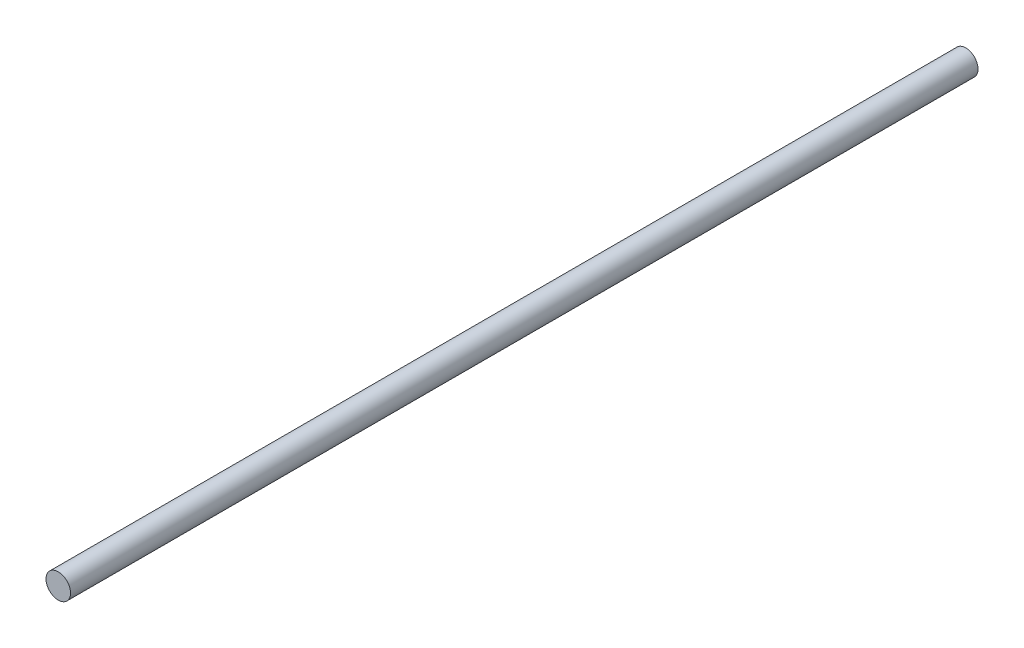
ISO-10303-21;
HEADER;
FILE_DESCRIPTION(('STEP AP214'),'2;1');
FILE_NAME('part.step','',(''),(''),'','','');
FILE_SCHEMA(('AUTOMOTIVE_DESIGN { 1 0 10303 214 1 1 1 1 }'));
ENDSEC;
DATA;
#1=APPLICATION_CONTEXT('core data for automotive mechanical design processes');
#2=APPLICATION_PROTOCOL_DEFINITION('international standard','automotive_design',2000,#1);
#3=PRODUCT_CONTEXT('',#1,'mechanical');
#4=PRODUCT('Part','Part','',(#3));
#5=PRODUCT_RELATED_PRODUCT_CATEGORY('part','',(#4));
#6=PRODUCT_DEFINITION_FORMATION('','',#4);
#7=PRODUCT_DEFINITION_CONTEXT('part definition',#1,'design');
#8=PRODUCT_DEFINITION('design','',#6,#7);
#9=PRODUCT_DEFINITION_SHAPE('','',#8);
#10=(LENGTH_UNIT() NAMED_UNIT(*) SI_UNIT(.MILLI.,.METRE.));
#11=(NAMED_UNIT(*) PLANE_ANGLE_UNIT() SI_UNIT($,.RADIAN.));
#12=(NAMED_UNIT(*) SI_UNIT($,.STERADIAN.) SOLID_ANGLE_UNIT());
#13=UNCERTAINTY_MEASURE_WITH_UNIT(LENGTH_MEASURE(1.E-05),#10,'distance_accuracy_value','');
#14=(GEOMETRIC_REPRESENTATION_CONTEXT(3) GLOBAL_UNCERTAINTY_ASSIGNED_CONTEXT((#13)) GLOBAL_UNIT_ASSIGNED_CONTEXT((#10,
#11,#12)) REPRESENTATION_CONTEXT('',''));
#15=CARTESIAN_POINT('',(0.,0.,0.));
#16=DIRECTION('',(0.,0.,1.));
#17=DIRECTION('',(1.,0.,0.));
#18=AXIS2_PLACEMENT_3D('',#15,#16,#17);
#19=CARTESIAN_POINT('',(0.,0.,287.5));
#20=DIRECTION('',(0.,0.,-1.));
#21=DIRECTION('',(-1.,0.,0.));
#22=AXIS2_PLACEMENT_3D('',#19,#20,#21);
#23=CYLINDRICAL_SURFACE('',#22,4.);
#24=CARTESIAN_POINT('',(0.,0.,332.5));
#25=DIRECTION('',(0.,0.,1.));
#26=DIRECTION('',(1.,0.,0.));
#27=AXIS2_PLACEMENT_3D('',#24,#25,#26);
#28=CIRCLE('',#27,4.);
#29=CARTESIAN_POINT('',(4.,0.,332.5));
#30=VERTEX_POINT('',#29);
#31=EDGE_CURVE('E10',#30,#30,#28,.T.);
#32=ORIENTED_EDGE('',*,*,#31,.F.);
#33=EDGE_LOOP('',(#32));
#34=FACE_BOUND('',#33,.T.);
#35=CARTESIAN_POINT('',(0.,0.,36.5));
#36=DIRECTION('',(0.,0.,-1.));
#37=DIRECTION('',(-1.,0.,0.));
#38=AXIS2_PLACEMENT_3D('',#35,#36,#37);
#39=CIRCLE('',#38,4.);
#40=CARTESIAN_POINT('',(-4.,0.,36.5));
#41=VERTEX_POINT('',#40);
#42=EDGE_CURVE('E41',#41,#41,#39,.T.);
#43=ORIENTED_EDGE('',*,*,#42,.F.);
#44=EDGE_LOOP('',(#43));
#45=FACE_BOUND('',#44,.T.);
#46=ADVANCED_FACE('F35',(#34,#45),#23,.T.);
#47=CARTESIAN_POINT('',(0.,0.,332.5));
#48=DIRECTION('',(0.,0.,1.));
#49=DIRECTION('',(1.,0.,0.));
#50=AXIS2_PLACEMENT_3D('',#47,#48,#49);
#51=PLANE('',#50);
#52=ORIENTED_EDGE('',*,*,#31,.T.);
#53=EDGE_LOOP('',(#52));
#54=FACE_BOUND('',#53,.T.);
#55=ADVANCED_FACE('F50',(#54),#51,.T.);
#56=CARTESIAN_POINT('',(0.,0.,36.5));
#57=DIRECTION('',(0.,0.,-1.));
#58=DIRECTION('',(-1.,0.,0.));
#59=AXIS2_PLACEMENT_3D('',#56,#57,#58);
#60=PLANE('',#59);
#61=ORIENTED_EDGE('',*,*,#42,.T.);
#62=EDGE_LOOP('',(#61));
#63=FACE_BOUND('',#62,.T.);
#64=ADVANCED_FACE('F47',(#63),#60,.T.);
#65=CLOSED_SHELL('',(#46,#55,#64));
#66=MANIFOLD_SOLID_BREP('B2',#65);
#67=ADVANCED_BREP_SHAPE_REPRESENTATION('',(#18,#66),#14);
#68=SHAPE_DEFINITION_REPRESENTATION(#9,#67);
ENDSEC;
END-ISO-10303-21;
